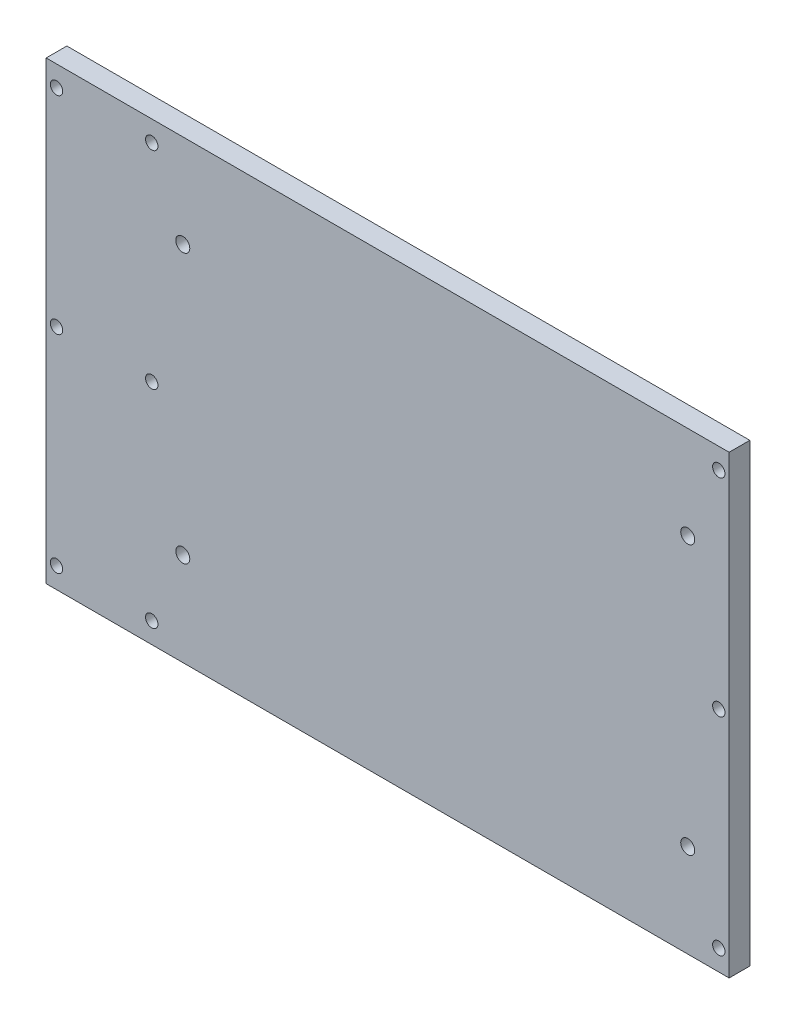
ISO-10303-21;
HEADER;
FILE_DESCRIPTION(('STEP AP214'),'2;1');
FILE_NAME('part.step','',(''),(''),'','','');
FILE_SCHEMA(('AUTOMOTIVE_DESIGN { 1 0 10303 214 1 1 1 1 }'));
ENDSEC;
DATA;
#1=APPLICATION_CONTEXT('core data for automotive mechanical design processes');
#2=APPLICATION_PROTOCOL_DEFINITION('international standard','automotive_design',2000,#1);
#3=PRODUCT_CONTEXT('',#1,'mechanical');
#4=PRODUCT('Part','Part','',(#3));
#5=PRODUCT_RELATED_PRODUCT_CATEGORY('part','',(#4));
#6=PRODUCT_DEFINITION_FORMATION('','',#4);
#7=PRODUCT_DEFINITION_CONTEXT('part definition',#1,'design');
#8=PRODUCT_DEFINITION('design','',#6,#7);
#9=PRODUCT_DEFINITION_SHAPE('','',#8);
#10=(LENGTH_UNIT() NAMED_UNIT(*) SI_UNIT(.MILLI.,.METRE.));
#11=(NAMED_UNIT(*) PLANE_ANGLE_UNIT() SI_UNIT($,.RADIAN.));
#12=(NAMED_UNIT(*) SI_UNIT($,.STERADIAN.) SOLID_ANGLE_UNIT());
#13=UNCERTAINTY_MEASURE_WITH_UNIT(LENGTH_MEASURE(1.E-05),#10,'distance_accuracy_value','');
#14=(GEOMETRIC_REPRESENTATION_CONTEXT(3) GLOBAL_UNCERTAINTY_ASSIGNED_CONTEXT((#13)) GLOBAL_UNIT_ASSIGNED_CONTEXT((#10,
#11,#12)) REPRESENTATION_CONTEXT('',''));
#15=CARTESIAN_POINT('',(0.,0.,0.));
#16=DIRECTION('',(0.,0.,1.));
#17=DIRECTION('',(1.,0.,0.));
#18=AXIS2_PLACEMENT_3D('',#15,#16,#17);
#19=CARTESIAN_POINT('',(-104.775,69.85,3.175));
#20=DIRECTION('',(1.,0.,0.));
#21=DIRECTION('',(0.,1.,0.));
#22=AXIS2_PLACEMENT_3D('',#19,#20,#21);
#23=PLANE('',#22);
#24=DIRECTION('',(0.,-1.,0.));
#25=VECTOR('',#24,1.);
#26=CARTESIAN_POINT('',(-104.775,69.85,-3.175));
#27=LINE('',#26,#25);
#28=CARTESIAN_POINT('',(-104.775,69.85,-3.175));
#29=VERTEX_POINT('',#28);
#30=CARTESIAN_POINT('',(-104.775,-69.85,-3.175));
#31=VERTEX_POINT('',#30);
#32=EDGE_CURVE('E113',#29,#31,#27,.T.);
#33=ORIENTED_EDGE('',*,*,#32,.T.);
#34=DIRECTION('',(0.,0.,-1.));
#35=VECTOR('',#34,1.);
#36=CARTESIAN_POINT('',(-104.775,-69.85,3.175));
#37=LINE('',#36,#35);
#38=CARTESIAN_POINT('',(-104.775,-69.85,3.175));
#39=VERTEX_POINT('',#38);
#40=EDGE_CURVE('E11',#39,#31,#37,.T.);
#41=ORIENTED_EDGE('',*,*,#40,.F.);
#42=DIRECTION('',(0.,-1.,0.));
#43=VECTOR('',#42,1.);
#44=CARTESIAN_POINT('',(-104.775,69.85,3.175));
#45=LINE('',#44,#43);
#46=CARTESIAN_POINT('',(-104.775,69.85,3.175));
#47=VERTEX_POINT('',#46);
#48=EDGE_CURVE('E95',#47,#39,#45,.T.);
#49=ORIENTED_EDGE('',*,*,#48,.F.);
#50=DIRECTION('',(0.,0.,-1.));
#51=VECTOR('',#50,1.);
#52=CARTESIAN_POINT('',(-104.775,69.85,3.175));
#53=LINE('',#52,#51);
#54=EDGE_CURVE('E109',#47,#29,#53,.T.);
#55=ORIENTED_EDGE('',*,*,#54,.T.);
#56=EDGE_LOOP('',(#33,#41,#49,#55));
#57=FACE_BOUND('',#56,.T.);
#58=ADVANCED_FACE('F41',(#57),#23,.F.);
#59=CARTESIAN_POINT('',(104.775,-69.85,3.175));
#60=DIRECTION('',(0.,1.,0.));
#61=DIRECTION('',(-1.,0.,0.));
#62=AXIS2_PLACEMENT_3D('',#59,#60,#61);
#63=PLANE('',#62);
#64=DIRECTION('',(1.,0.,0.));
#65=VECTOR('',#64,1.);
#66=CARTESIAN_POINT('',(104.775,-69.85,-3.175));
#67=LINE('',#66,#65);
#68=CARTESIAN_POINT('',(104.775,-69.85,-3.175));
#69=VERTEX_POINT('',#68);
#70=EDGE_CURVE('E100',#31,#69,#67,.T.);
#71=ORIENTED_EDGE('',*,*,#70,.T.);
#72=DIRECTION('',(0.,0.,-1.));
#73=VECTOR('',#72,1.);
#74=CARTESIAN_POINT('',(104.775,-69.85,3.175));
#75=LINE('',#74,#73);
#76=CARTESIAN_POINT('',(104.775,-69.85,3.175));
#77=VERTEX_POINT('',#76);
#78=EDGE_CURVE('E51',#77,#69,#75,.T.);
#79=ORIENTED_EDGE('',*,*,#78,.F.);
#80=DIRECTION('',(1.,0.,0.));
#81=VECTOR('',#80,1.);
#82=CARTESIAN_POINT('',(104.775,-69.85,3.175));
#83=LINE('',#82,#81);
#84=EDGE_CURVE('E90',#39,#77,#83,.T.);
#85=ORIENTED_EDGE('',*,*,#84,.F.);
#86=ORIENTED_EDGE('',*,*,#40,.T.);
#87=EDGE_LOOP('',(#71,#79,#85,#86));
#88=FACE_BOUND('',#87,.T.);
#89=ADVANCED_FACE('F99',(#88),#63,.F.);
#90=CARTESIAN_POINT('',(104.775,69.85,3.175));
#91=DIRECTION('',(-1.,0.,0.));
#92=DIRECTION('',(0.,-1.,0.));
#93=AXIS2_PLACEMENT_3D('',#90,#91,#92);
#94=PLANE('',#93);
#95=DIRECTION('',(0.,1.,0.));
#96=VECTOR('',#95,1.);
#97=CARTESIAN_POINT('',(104.775,69.85,-3.175));
#98=LINE('',#97,#96);
#99=CARTESIAN_POINT('',(104.775,69.85,-3.175));
#100=VERTEX_POINT('',#99);
#101=EDGE_CURVE('E77',#69,#100,#98,.T.);
#102=ORIENTED_EDGE('',*,*,#101,.T.);
#103=DIRECTION('',(0.,0.,-1.));
#104=VECTOR('',#103,1.);
#105=CARTESIAN_POINT('',(104.775,69.85,3.175));
#106=LINE('',#105,#104);
#107=CARTESIAN_POINT('',(104.775,69.85,3.175));
#108=VERTEX_POINT('',#107);
#109=EDGE_CURVE('E102',#108,#100,#106,.T.);
#110=ORIENTED_EDGE('',*,*,#109,.F.);
#111=DIRECTION('',(0.,1.,0.));
#112=VECTOR('',#111,1.);
#113=CARTESIAN_POINT('',(104.775,69.85,3.175));
#114=LINE('',#113,#112);
#115=EDGE_CURVE('E93',#77,#108,#114,.T.);
#116=ORIENTED_EDGE('',*,*,#115,.F.);
#117=ORIENTED_EDGE('',*,*,#78,.T.);
#118=EDGE_LOOP('',(#102,#110,#116,#117));
#119=FACE_BOUND('',#118,.T.);
#120=ADVANCED_FACE('F104',(#119),#94,.F.);
#121=CARTESIAN_POINT('',(104.775,69.85,3.175));
#122=DIRECTION('',(0.,-1.,0.));
#123=DIRECTION('',(1.,0.,0.));
#124=AXIS2_PLACEMENT_3D('',#121,#122,#123);
#125=PLANE('',#124);
#126=DIRECTION('',(-1.,0.,0.));
#127=VECTOR('',#126,1.);
#128=CARTESIAN_POINT('',(104.775,69.85,-3.175));
#129=LINE('',#128,#127);
#130=EDGE_CURVE('E83',#100,#29,#129,.T.);
#131=ORIENTED_EDGE('',*,*,#130,.T.);
#132=ORIENTED_EDGE('',*,*,#54,.F.);
#133=DIRECTION('',(-1.,0.,0.));
#134=VECTOR('',#133,1.);
#135=CARTESIAN_POINT('',(104.775,69.85,3.175));
#136=LINE('',#135,#134);
#137=EDGE_CURVE('E60',#108,#47,#136,.T.);
#138=ORIENTED_EDGE('',*,*,#137,.F.);
#139=ORIENTED_EDGE('',*,*,#109,.T.);
#140=EDGE_LOOP('',(#131,#132,#138,#139));
#141=FACE_BOUND('',#140,.T.);
#142=ADVANCED_FACE('F311',(#141),#125,.F.);
#143=CARTESIAN_POINT('',(0.,0.,3.175));
#144=DIRECTION('',(0.,0.,-1.));
#145=DIRECTION('',(-1.,0.,0.));
#146=AXIS2_PLACEMENT_3D('',#143,#144,#145);
#147=PLANE('',#146);
#148=CARTESIAN_POINT('',(101.6,63.5,3.17499999999999));
#149=DIRECTION('',(0.,0.,-1.));
#150=DIRECTION('',(-1.,0.,0.));
#151=AXIS2_PLACEMENT_3D('',#148,#149,#150);
#152=CIRCLE('',#151,1.89864999999999);
#153=CARTESIAN_POINT('',(99.70135,63.5,3.17499999999999));
#154=VERTEX_POINT('',#153);
#155=EDGE_CURVE('E265',#154,#154,#152,.T.);
#156=ORIENTED_EDGE('',*,*,#155,.T.);
#157=EDGE_LOOP('',(#156));
#158=FACE_BOUND('',#157,.T.);
#159=CARTESIAN_POINT('',(101.6,0.,3.17499999999999));
#160=DIRECTION('',(0.,0.,-1.));
#161=DIRECTION('',(-1.,0.,0.));
#162=AXIS2_PLACEMENT_3D('',#159,#160,#161);
#163=CIRCLE('',#162,1.89864999999999);
#164=CARTESIAN_POINT('',(99.70135,0.,3.17499999999999));
#165=VERTEX_POINT('',#164);
#166=EDGE_CURVE('E253',#165,#165,#163,.T.);
#167=ORIENTED_EDGE('',*,*,#166,.T.);
#168=EDGE_LOOP('',(#167));
#169=FACE_BOUND('',#168,.T.);
#170=CARTESIAN_POINT('',(101.6,-63.5,3.17499999999999));
#171=DIRECTION('',(0.,0.,-1.));
#172=DIRECTION('',(-1.,0.,0.));
#173=AXIS2_PLACEMENT_3D('',#170,#171,#172);
#174=CIRCLE('',#173,1.89864999999999);
#175=CARTESIAN_POINT('',(99.70135,-63.5,3.17499999999999));
#176=VERTEX_POINT('',#175);
#177=EDGE_CURVE('E241',#176,#176,#174,.T.);
#178=ORIENTED_EDGE('',*,*,#177,.T.);
#179=EDGE_LOOP('',(#178));
#180=FACE_BOUND('',#179,.T.);
#181=CARTESIAN_POINT('',(-72.39,63.5,3.17499999999999));
#182=DIRECTION('',(0.,0.,-1.));
#183=DIRECTION('',(-1.,0.,0.));
#184=AXIS2_PLACEMENT_3D('',#181,#182,#183);
#185=CIRCLE('',#184,1.89864999999999);
#186=CARTESIAN_POINT('',(-74.28865,63.5,3.17499999999999));
#187=VERTEX_POINT('',#186);
#188=EDGE_CURVE('E229',#187,#187,#185,.T.);
#189=ORIENTED_EDGE('',*,*,#188,.T.);
#190=EDGE_LOOP('',(#189));
#191=FACE_BOUND('',#190,.T.);
#192=CARTESIAN_POINT('',(-72.39,0.,3.17499999999999));
#193=DIRECTION('',(0.,0.,-1.));
#194=DIRECTION('',(-1.,0.,0.));
#195=AXIS2_PLACEMENT_3D('',#192,#193,#194);
#196=CIRCLE('',#195,1.89864999999999);
#197=CARTESIAN_POINT('',(-74.28865,0.,3.17499999999999));
#198=VERTEX_POINT('',#197);
#199=EDGE_CURVE('E217',#198,#198,#196,.T.);
#200=ORIENTED_EDGE('',*,*,#199,.T.);
#201=EDGE_LOOP('',(#200));
#202=FACE_BOUND('',#201,.T.);
#203=CARTESIAN_POINT('',(-72.39,-63.5,3.17499999999999));
#204=DIRECTION('',(0.,0.,-1.));
#205=DIRECTION('',(-1.,0.,0.));
#206=AXIS2_PLACEMENT_3D('',#203,#204,#205);
#207=CIRCLE('',#206,1.89864999999999);
#208=CARTESIAN_POINT('',(-74.28865,-63.5,3.17499999999999));
#209=VERTEX_POINT('',#208);
#210=EDGE_CURVE('E205',#209,#209,#207,.T.);
#211=ORIENTED_EDGE('',*,*,#210,.T.);
#212=EDGE_LOOP('',(#211));
#213=FACE_BOUND('',#212,.T.);
#214=CARTESIAN_POINT('',(-101.6,-63.5,3.17499999999999));
#215=DIRECTION('',(0.,0.,-1.));
#216=DIRECTION('',(-1.,0.,0.));
#217=AXIS2_PLACEMENT_3D('',#214,#215,#216);
#218=CIRCLE('',#217,1.89864999999999);
#219=CARTESIAN_POINT('',(-103.49865,-63.5,3.17499999999999));
#220=VERTEX_POINT('',#219);
#221=EDGE_CURVE('E193',#220,#220,#218,.T.);
#222=ORIENTED_EDGE('',*,*,#221,.T.);
#223=EDGE_LOOP('',(#222));
#224=FACE_BOUND('',#223,.T.);
#225=CARTESIAN_POINT('',(-101.6,0.,3.17499999999999));
#226=DIRECTION('',(0.,0.,-1.));
#227=DIRECTION('',(-1.,0.,0.));
#228=AXIS2_PLACEMENT_3D('',#225,#226,#227);
#229=CIRCLE('',#228,1.89864999999999);
#230=CARTESIAN_POINT('',(-103.49865,0.,3.17499999999999));
#231=VERTEX_POINT('',#230);
#232=EDGE_CURVE('E181',#231,#231,#229,.T.);
#233=ORIENTED_EDGE('',*,*,#232,.T.);
#234=EDGE_LOOP('',(#233));
#235=FACE_BOUND('',#234,.T.);
#236=CARTESIAN_POINT('',(-101.6,63.5,3.17499999999999));
#237=DIRECTION('',(0.,0.,-1.));
#238=DIRECTION('',(-1.,0.,0.));
#239=AXIS2_PLACEMENT_3D('',#236,#237,#238);
#240=CIRCLE('',#239,1.89864999999999);
#241=CARTESIAN_POINT('',(-103.49865,63.5,3.17499999999999));
#242=VERTEX_POINT('',#241);
#243=EDGE_CURVE('E169',#242,#242,#240,.T.);
#244=ORIENTED_EDGE('',*,*,#243,.T.);
#245=EDGE_LOOP('',(#244));
#246=FACE_BOUND('',#245,.T.);
#247=CARTESIAN_POINT('',(-62.865,41.275,3.175));
#248=DIRECTION('',(0.,0.,1.));
#249=DIRECTION('',(1.,0.,0.));
#250=AXIS2_PLACEMENT_3D('',#247,#248,#249);
#251=CIRCLE('',#250,2.15265);
#252=CARTESIAN_POINT('',(-60.71235,41.275,3.175));
#253=VERTEX_POINT('',#252);
#254=EDGE_CURVE('E165',#253,#253,#251,.T.);
#255=ORIENTED_EDGE('',*,*,#254,.F.);
#256=EDGE_LOOP('',(#255));
#257=FACE_BOUND('',#256,.T.);
#258=CARTESIAN_POINT('',(92.075,41.275,3.175));
#259=DIRECTION('',(0.,0.,1.));
#260=DIRECTION('',(1.,0.,0.));
#261=AXIS2_PLACEMENT_3D('',#258,#259,#260);
#262=CIRCLE('',#261,2.15265000000001);
#263=CARTESIAN_POINT('',(94.22765,41.275,3.175));
#264=VERTEX_POINT('',#263);
#265=EDGE_CURVE('E157',#264,#264,#262,.T.);
#266=ORIENTED_EDGE('',*,*,#265,.F.);
#267=EDGE_LOOP('',(#266));
#268=FACE_BOUND('',#267,.T.);
#269=CARTESIAN_POINT('',(92.075,-41.275,3.175));
#270=DIRECTION('',(0.,0.,1.));
#271=DIRECTION('',(1.,0.,0.));
#272=AXIS2_PLACEMENT_3D('',#269,#270,#271);
#273=CIRCLE('',#272,2.15265000000001);
#274=CARTESIAN_POINT('',(94.22765,-41.275,3.175));
#275=VERTEX_POINT('',#274);
#276=EDGE_CURVE('E141',#275,#275,#273,.T.);
#277=ORIENTED_EDGE('',*,*,#276,.F.);
#278=EDGE_LOOP('',(#277));
#279=FACE_BOUND('',#278,.T.);
#280=CARTESIAN_POINT('',(-62.865,-41.275,3.175));
#281=DIRECTION('',(0.,0.,1.));
#282=DIRECTION('',(1.,0.,0.));
#283=AXIS2_PLACEMENT_3D('',#280,#281,#282);
#284=CIRCLE('',#283,2.15265);
#285=CARTESIAN_POINT('',(-60.71235,-41.275,3.175));
#286=VERTEX_POINT('',#285);
#287=EDGE_CURVE('E129',#286,#286,#284,.T.);
#288=ORIENTED_EDGE('',*,*,#287,.F.);
#289=EDGE_LOOP('',(#288));
#290=FACE_BOUND('',#289,.T.);
#291=ORIENTED_EDGE('',*,*,#48,.T.);
#292=ORIENTED_EDGE('',*,*,#84,.T.);
#293=ORIENTED_EDGE('',*,*,#115,.T.);
#294=ORIENTED_EDGE('',*,*,#137,.T.);
#295=EDGE_LOOP('',(#291,#292,#293,#294));
#296=FACE_BOUND('',#295,.T.);
#297=ADVANCED_FACE('F91',(#158,#169,#180,#191,#202,#213,#224,#235,#246,#257,#268,#279,#290,
#296),#147,.F.);
#298=CARTESIAN_POINT('',(0.,0.,-3.175));
#299=DIRECTION('',(0.,0.,-1.));
#300=DIRECTION('',(-1.,0.,0.));
#301=AXIS2_PLACEMENT_3D('',#298,#299,#300);
#302=PLANE('',#301);
#303=CARTESIAN_POINT('',(101.6,63.5,-3.175));
#304=DIRECTION('',(0.,0.,-1.));
#305=DIRECTION('',(-1.,0.,0.));
#306=AXIS2_PLACEMENT_3D('',#303,#304,#305);
#307=CIRCLE('',#306,2.53365);
#308=CARTESIAN_POINT('',(99.06635,63.5,-3.175));
#309=VERTEX_POINT('',#308);
#310=EDGE_CURVE('E273',#309,#309,#307,.T.);
#311=ORIENTED_EDGE('',*,*,#310,.F.);
#312=EDGE_LOOP('',(#311));
#313=FACE_BOUND('',#312,.T.);
#314=CARTESIAN_POINT('',(101.6,0.,-3.175));
#315=DIRECTION('',(0.,0.,-1.));
#316=DIRECTION('',(-1.,0.,0.));
#317=AXIS2_PLACEMENT_3D('',#314,#315,#316);
#318=CIRCLE('',#317,2.53365);
#319=CARTESIAN_POINT('',(99.06635,0.,-3.175));
#320=VERTEX_POINT('',#319);
#321=EDGE_CURVE('E261',#320,#320,#318,.T.);
#322=ORIENTED_EDGE('',*,*,#321,.F.);
#323=EDGE_LOOP('',(#322));
#324=FACE_BOUND('',#323,.T.);
#325=CARTESIAN_POINT('',(101.6,-63.5,-3.175));
#326=DIRECTION('',(0.,0.,-1.));
#327=DIRECTION('',(-1.,0.,0.));
#328=AXIS2_PLACEMENT_3D('',#325,#326,#327);
#329=CIRCLE('',#328,2.53365);
#330=CARTESIAN_POINT('',(99.06635,-63.5,-3.175));
#331=VERTEX_POINT('',#330);
#332=EDGE_CURVE('E249',#331,#331,#329,.T.);
#333=ORIENTED_EDGE('',*,*,#332,.F.);
#334=EDGE_LOOP('',(#333));
#335=FACE_BOUND('',#334,.T.);
#336=CARTESIAN_POINT('',(-72.39,63.5,-3.175));
#337=DIRECTION('',(0.,0.,-1.));
#338=DIRECTION('',(-1.,0.,0.));
#339=AXIS2_PLACEMENT_3D('',#336,#337,#338);
#340=CIRCLE('',#339,2.53365);
#341=CARTESIAN_POINT('',(-74.92365,63.5,-3.175));
#342=VERTEX_POINT('',#341);
#343=EDGE_CURVE('E237',#342,#342,#340,.T.);
#344=ORIENTED_EDGE('',*,*,#343,.F.);
#345=EDGE_LOOP('',(#344));
#346=FACE_BOUND('',#345,.T.);
#347=CARTESIAN_POINT('',(-72.39,0.,-3.175));
#348=DIRECTION('',(0.,0.,-1.));
#349=DIRECTION('',(-1.,0.,0.));
#350=AXIS2_PLACEMENT_3D('',#347,#348,#349);
#351=CIRCLE('',#350,2.53365);
#352=CARTESIAN_POINT('',(-74.92365,0.,-3.175));
#353=VERTEX_POINT('',#352);
#354=EDGE_CURVE('E225',#353,#353,#351,.T.);
#355=ORIENTED_EDGE('',*,*,#354,.F.);
#356=EDGE_LOOP('',(#355));
#357=FACE_BOUND('',#356,.T.);
#358=CARTESIAN_POINT('',(-72.39,-63.5,-3.175));
#359=DIRECTION('',(0.,0.,-1.));
#360=DIRECTION('',(-1.,0.,0.));
#361=AXIS2_PLACEMENT_3D('',#358,#359,#360);
#362=CIRCLE('',#361,2.53365);
#363=CARTESIAN_POINT('',(-74.92365,-63.5,-3.175));
#364=VERTEX_POINT('',#363);
#365=EDGE_CURVE('E213',#364,#364,#362,.T.);
#366=ORIENTED_EDGE('',*,*,#365,.F.);
#367=EDGE_LOOP('',(#366));
#368=FACE_BOUND('',#367,.T.);
#369=CARTESIAN_POINT('',(-101.6,-63.5,-3.175));
#370=DIRECTION('',(0.,0.,-1.));
#371=DIRECTION('',(-1.,0.,0.));
#372=AXIS2_PLACEMENT_3D('',#369,#370,#371);
#373=CIRCLE('',#372,2.53365);
#374=CARTESIAN_POINT('',(-104.13365,-63.5,-3.175));
#375=VERTEX_POINT('',#374);
#376=EDGE_CURVE('E201',#375,#375,#373,.T.);
#377=ORIENTED_EDGE('',*,*,#376,.F.);
#378=EDGE_LOOP('',(#377));
#379=FACE_BOUND('',#378,.T.);
#380=CARTESIAN_POINT('',(-101.6,0.,-3.175));
#381=DIRECTION('',(0.,0.,-1.));
#382=DIRECTION('',(-1.,0.,0.));
#383=AXIS2_PLACEMENT_3D('',#380,#381,#382);
#384=CIRCLE('',#383,2.53365);
#385=CARTESIAN_POINT('',(-104.13365,0.,-3.175));
#386=VERTEX_POINT('',#385);
#387=EDGE_CURVE('E189',#386,#386,#384,.T.);
#388=ORIENTED_EDGE('',*,*,#387,.F.);
#389=EDGE_LOOP('',(#388));
#390=FACE_BOUND('',#389,.T.);
#391=CARTESIAN_POINT('',(-101.6,63.5,-3.175));
#392=DIRECTION('',(0.,0.,-1.));
#393=DIRECTION('',(-1.,0.,0.));
#394=AXIS2_PLACEMENT_3D('',#391,#392,#393);
#395=CIRCLE('',#394,2.53365);
#396=CARTESIAN_POINT('',(-104.13365,63.5,-3.175));
#397=VERTEX_POINT('',#396);
#398=EDGE_CURVE('E177',#397,#397,#395,.T.);
#399=ORIENTED_EDGE('',*,*,#398,.F.);
#400=EDGE_LOOP('',(#399));
#401=FACE_BOUND('',#400,.T.);
#402=CARTESIAN_POINT('',(-62.865,41.275,-3.175));
#403=DIRECTION('',(0.,0.,-1.));
#404=DIRECTION('',(-1.,0.,0.));
#405=AXIS2_PLACEMENT_3D('',#402,#403,#404);
#406=CIRCLE('',#405,2.15265);
#407=CARTESIAN_POINT('',(-65.01765,41.275,-3.175));
#408=VERTEX_POINT('',#407);
#409=EDGE_CURVE('E161',#408,#408,#406,.T.);
#410=ORIENTED_EDGE('',*,*,#409,.F.);
#411=EDGE_LOOP('',(#410));
#412=FACE_BOUND('',#411,.T.);
#413=CARTESIAN_POINT('',(92.075,41.275,-3.175));
#414=DIRECTION('',(0.,0.,-1.));
#415=DIRECTION('',(-1.,0.,0.));
#416=AXIS2_PLACEMENT_3D('',#413,#414,#415);
#417=CIRCLE('',#416,2.15265);
#418=CARTESIAN_POINT('',(89.92235,41.275,-3.175));
#419=VERTEX_POINT('',#418);
#420=EDGE_CURVE('E153',#419,#419,#417,.T.);
#421=ORIENTED_EDGE('',*,*,#420,.F.);
#422=EDGE_LOOP('',(#421));
#423=FACE_BOUND('',#422,.T.);
#424=CARTESIAN_POINT('',(92.075,-41.275,-3.175));
#425=DIRECTION('',(0.,0.,-1.));
#426=DIRECTION('',(-1.,0.,0.));
#427=AXIS2_PLACEMENT_3D('',#424,#425,#426);
#428=CIRCLE('',#427,2.15265);
#429=CARTESIAN_POINT('',(89.92235,-41.275,-3.175));
#430=VERTEX_POINT('',#429);
#431=EDGE_CURVE('E44',#430,#430,#428,.T.);
#432=ORIENTED_EDGE('',*,*,#431,.F.);
#433=EDGE_LOOP('',(#432));
#434=FACE_BOUND('',#433,.T.);
#435=CARTESIAN_POINT('',(-62.865,-41.275,-3.175));
#436=DIRECTION('',(0.,0.,-1.));
#437=DIRECTION('',(-1.,0.,0.));
#438=AXIS2_PLACEMENT_3D('',#435,#436,#437);
#439=CIRCLE('',#438,2.15265);
#440=CARTESIAN_POINT('',(-65.01765,-41.275,-3.175));
#441=VERTEX_POINT('',#440);
#442=EDGE_CURVE('E117',#441,#441,#439,.T.);
#443=ORIENTED_EDGE('',*,*,#442,.F.);
#444=EDGE_LOOP('',(#443));
#445=FACE_BOUND('',#444,.T.);
#446=ORIENTED_EDGE('',*,*,#32,.F.);
#447=ORIENTED_EDGE('',*,*,#130,.F.);
#448=ORIENTED_EDGE('',*,*,#101,.F.);
#449=ORIENTED_EDGE('',*,*,#70,.F.);
#450=EDGE_LOOP('',(#446,#447,#448,#449));
#451=FACE_BOUND('',#450,.T.);
#452=ADVANCED_FACE('F281',(#313,#324,#335,#346,#357,#368,#379,#390,#401,#412,#423,#434,#445,
#451),#302,.T.);
#453=CARTESIAN_POINT('',(-62.865,-41.275,3.175));
#454=DIRECTION('',(0.,0.,1.));
#455=DIRECTION('',(1.,0.,0.));
#456=AXIS2_PLACEMENT_3D('',#453,#454,#455);
#457=CYLINDRICAL_SURFACE('',#456,2.15265);
#458=ORIENTED_EDGE('',*,*,#442,.T.);
#459=EDGE_LOOP('',(#458));
#460=FACE_BOUND('',#459,.T.);
#461=ORIENTED_EDGE('',*,*,#287,.T.);
#462=EDGE_LOOP('',(#461));
#463=FACE_BOUND('',#462,.T.);
#464=ADVANCED_FACE('F284',(#460,#463),#457,.F.);
#465=CARTESIAN_POINT('',(92.075,-41.275,3.175));
#466=DIRECTION('',(0.,0.,1.));
#467=DIRECTION('',(1.,0.,0.));
#468=AXIS2_PLACEMENT_3D('',#465,#466,#467);
#469=CYLINDRICAL_SURFACE('',#468,2.15265);
#470=ORIENTED_EDGE('',*,*,#431,.T.);
#471=EDGE_LOOP('',(#470));
#472=FACE_BOUND('',#471,.T.);
#473=ORIENTED_EDGE('',*,*,#276,.T.);
#474=EDGE_LOOP('',(#473));
#475=FACE_BOUND('',#474,.T.);
#476=ADVANCED_FACE('F345',(#472,#475),#469,.F.);
#477=CARTESIAN_POINT('',(92.075,41.275,3.175));
#478=DIRECTION('',(0.,0.,1.));
#479=DIRECTION('',(1.,0.,0.));
#480=AXIS2_PLACEMENT_3D('',#477,#478,#479);
#481=CYLINDRICAL_SURFACE('',#480,2.15265);
#482=ORIENTED_EDGE('',*,*,#420,.T.);
#483=EDGE_LOOP('',(#482));
#484=FACE_BOUND('',#483,.T.);
#485=ORIENTED_EDGE('',*,*,#265,.T.);
#486=EDGE_LOOP('',(#485));
#487=FACE_BOUND('',#486,.T.);
#488=ADVANCED_FACE('F355',(#484,#487),#481,.F.);
#489=CARTESIAN_POINT('',(-62.865,41.275,3.175));
#490=DIRECTION('',(0.,0.,1.));
#491=DIRECTION('',(1.,0.,0.));
#492=AXIS2_PLACEMENT_3D('',#489,#490,#491);
#493=CYLINDRICAL_SURFACE('',#492,2.15265);
#494=ORIENTED_EDGE('',*,*,#409,.T.);
#495=EDGE_LOOP('',(#494));
#496=FACE_BOUND('',#495,.T.);
#497=ORIENTED_EDGE('',*,*,#254,.T.);
#498=EDGE_LOOP('',(#497));
#499=FACE_BOUND('',#498,.T.);
#500=ADVANCED_FACE('F365',(#496,#499),#493,.F.);
#501=CARTESIAN_POINT('',(-101.6,63.5,-3.175));
#502=DIRECTION('',(0.,0.,-1.));
#503=DIRECTION('',(-1.,0.,0.));
#504=AXIS2_PLACEMENT_3D('',#501,#502,#503);
#505=CYLINDRICAL_SURFACE('',#504,1.89864999999999);
#506=ORIENTED_EDGE('',*,*,#243,.F.);
#507=EDGE_LOOP('',(#506));
#508=FACE_BOUND('',#507,.T.);
#509=CARTESIAN_POINT('',(-101.6,63.5,-2.54));
#510=DIRECTION('',(0.,0.,-1.));
#511=DIRECTION('',(-1.,0.,0.));
#512=AXIS2_PLACEMENT_3D('',#509,#510,#511);
#513=CIRCLE('',#512,1.89865);
#514=CARTESIAN_POINT('',(-103.49865,63.5,-2.54));
#515=VERTEX_POINT('',#514);
#516=EDGE_CURVE('E173',#515,#515,#513,.T.);
#517=ORIENTED_EDGE('',*,*,#516,.T.);
#518=EDGE_LOOP('',(#517));
#519=FACE_BOUND('',#518,.T.);
#520=ADVANCED_FACE('F375',(#508,#519),#505,.F.);
#521=CARTESIAN_POINT('',(-101.6,63.5,-3.175));
#522=DIRECTION('',(0.,0.,-1.));
#523=DIRECTION('',(-1.,0.,0.));
#524=AXIS2_PLACEMENT_3D('',#521,#522,#523);
#525=CONICAL_SURFACE('',#524,2.53365,0.785398163397446);
#526=ORIENTED_EDGE('',*,*,#516,.F.);
#527=EDGE_LOOP('',(#526));
#528=FACE_BOUND('',#527,.T.);
#529=ORIENTED_EDGE('',*,*,#398,.T.);
#530=EDGE_LOOP('',(#529));
#531=FACE_BOUND('',#530,.T.);
#532=ADVANCED_FACE('F395',(#528,#531),#525,.F.);
#533=CARTESIAN_POINT('',(-101.6,0.,-3.175));
#534=DIRECTION('',(0.,0.,-1.));
#535=DIRECTION('',(-1.,0.,0.));
#536=AXIS2_PLACEMENT_3D('',#533,#534,#535);
#537=CYLINDRICAL_SURFACE('',#536,1.89864999999999);
#538=ORIENTED_EDGE('',*,*,#232,.F.);
#539=EDGE_LOOP('',(#538));
#540=FACE_BOUND('',#539,.T.);
#541=CARTESIAN_POINT('',(-101.6,0.,-2.54));
#542=DIRECTION('',(0.,0.,-1.));
#543=DIRECTION('',(-1.,0.,0.));
#544=AXIS2_PLACEMENT_3D('',#541,#542,#543);
#545=CIRCLE('',#544,1.89865);
#546=CARTESIAN_POINT('',(-103.49865,0.,-2.54));
#547=VERTEX_POINT('',#546);
#548=EDGE_CURVE('E185',#547,#547,#545,.T.);
#549=ORIENTED_EDGE('',*,*,#548,.T.);
#550=EDGE_LOOP('',(#549));
#551=FACE_BOUND('',#550,.T.);
#552=ADVANCED_FACE('F405',(#540,#551),#537,.F.);
#553=CARTESIAN_POINT('',(-101.6,0.,-3.175));
#554=DIRECTION('',(0.,0.,-1.));
#555=DIRECTION('',(-1.,0.,0.));
#556=AXIS2_PLACEMENT_3D('',#553,#554,#555);
#557=CONICAL_SURFACE('',#556,2.53365,0.785398163397446);
#558=ORIENTED_EDGE('',*,*,#548,.F.);
#559=EDGE_LOOP('',(#558));
#560=FACE_BOUND('',#559,.T.);
#561=ORIENTED_EDGE('',*,*,#387,.T.);
#562=EDGE_LOOP('',(#561));
#563=FACE_BOUND('',#562,.T.);
#564=ADVANCED_FACE('F415',(#560,#563),#557,.F.);
#565=CARTESIAN_POINT('',(-101.6,-63.5,-3.175));
#566=DIRECTION('',(0.,0.,-1.));
#567=DIRECTION('',(-1.,0.,0.));
#568=AXIS2_PLACEMENT_3D('',#565,#566,#567);
#569=CYLINDRICAL_SURFACE('',#568,1.89864999999999);
#570=ORIENTED_EDGE('',*,*,#221,.F.);
#571=EDGE_LOOP('',(#570));
#572=FACE_BOUND('',#571,.T.);
#573=CARTESIAN_POINT('',(-101.6,-63.5,-2.54));
#574=DIRECTION('',(0.,0.,-1.));
#575=DIRECTION('',(-1.,0.,0.));
#576=AXIS2_PLACEMENT_3D('',#573,#574,#575);
#577=CIRCLE('',#576,1.89865);
#578=CARTESIAN_POINT('',(-103.49865,-63.5,-2.54));
#579=VERTEX_POINT('',#578);
#580=EDGE_CURVE('E197',#579,#579,#577,.T.);
#581=ORIENTED_EDGE('',*,*,#580,.T.);
#582=EDGE_LOOP('',(#581));
#583=FACE_BOUND('',#582,.T.);
#584=ADVANCED_FACE('F425',(#572,#583),#569,.F.);
#585=CARTESIAN_POINT('',(-101.6,-63.5,-3.175));
#586=DIRECTION('',(0.,0.,-1.));
#587=DIRECTION('',(-1.,0.,0.));
#588=AXIS2_PLACEMENT_3D('',#585,#586,#587);
#589=CONICAL_SURFACE('',#588,2.53365,0.785398163397446);
#590=ORIENTED_EDGE('',*,*,#580,.F.);
#591=EDGE_LOOP('',(#590));
#592=FACE_BOUND('',#591,.T.);
#593=ORIENTED_EDGE('',*,*,#376,.T.);
#594=EDGE_LOOP('',(#593));
#595=FACE_BOUND('',#594,.T.);
#596=ADVANCED_FACE('F435',(#592,#595),#589,.F.);
#597=CARTESIAN_POINT('',(-72.39,-63.5,-3.175));
#598=DIRECTION('',(0.,0.,-1.));
#599=DIRECTION('',(-1.,0.,0.));
#600=AXIS2_PLACEMENT_3D('',#597,#598,#599);
#601=CYLINDRICAL_SURFACE('',#600,1.89864999999999);
#602=ORIENTED_EDGE('',*,*,#210,.F.);
#603=EDGE_LOOP('',(#602));
#604=FACE_BOUND('',#603,.T.);
#605=CARTESIAN_POINT('',(-72.39,-63.5,-2.54));
#606=DIRECTION('',(0.,0.,-1.));
#607=DIRECTION('',(-1.,0.,0.));
#608=AXIS2_PLACEMENT_3D('',#605,#606,#607);
#609=CIRCLE('',#608,1.89865);
#610=CARTESIAN_POINT('',(-74.28865,-63.5,-2.54));
#611=VERTEX_POINT('',#610);
#612=EDGE_CURVE('E209',#611,#611,#609,.T.);
#613=ORIENTED_EDGE('',*,*,#612,.T.);
#614=EDGE_LOOP('',(#613));
#615=FACE_BOUND('',#614,.T.);
#616=ADVANCED_FACE('F445',(#604,#615),#601,.F.);
#617=CARTESIAN_POINT('',(-72.39,-63.5,-3.175));
#618=DIRECTION('',(0.,0.,-1.));
#619=DIRECTION('',(-1.,0.,0.));
#620=AXIS2_PLACEMENT_3D('',#617,#618,#619);
#621=CONICAL_SURFACE('',#620,2.53365,0.785398163397446);
#622=ORIENTED_EDGE('',*,*,#612,.F.);
#623=EDGE_LOOP('',(#622));
#624=FACE_BOUND('',#623,.T.);
#625=ORIENTED_EDGE('',*,*,#365,.T.);
#626=EDGE_LOOP('',(#625));
#627=FACE_BOUND('',#626,.T.);
#628=ADVANCED_FACE('F455',(#624,#627),#621,.F.);
#629=CARTESIAN_POINT('',(-72.39,0.,-3.175));
#630=DIRECTION('',(0.,0.,-1.));
#631=DIRECTION('',(-1.,0.,0.));
#632=AXIS2_PLACEMENT_3D('',#629,#630,#631);
#633=CYLINDRICAL_SURFACE('',#632,1.89864999999999);
#634=ORIENTED_EDGE('',*,*,#199,.F.);
#635=EDGE_LOOP('',(#634));
#636=FACE_BOUND('',#635,.T.);
#637=CARTESIAN_POINT('',(-72.39,0.,-2.54));
#638=DIRECTION('',(0.,0.,-1.));
#639=DIRECTION('',(-1.,0.,0.));
#640=AXIS2_PLACEMENT_3D('',#637,#638,#639);
#641=CIRCLE('',#640,1.89865);
#642=CARTESIAN_POINT('',(-74.28865,0.,-2.54));
#643=VERTEX_POINT('',#642);
#644=EDGE_CURVE('E221',#643,#643,#641,.T.);
#645=ORIENTED_EDGE('',*,*,#644,.T.);
#646=EDGE_LOOP('',(#645));
#647=FACE_BOUND('',#646,.T.);
#648=ADVANCED_FACE('F465',(#636,#647),#633,.F.);
#649=CARTESIAN_POINT('',(-72.39,0.,-3.175));
#650=DIRECTION('',(0.,0.,-1.));
#651=DIRECTION('',(-1.,0.,0.));
#652=AXIS2_PLACEMENT_3D('',#649,#650,#651);
#653=CONICAL_SURFACE('',#652,2.53365,0.785398163397446);
#654=ORIENTED_EDGE('',*,*,#644,.F.);
#655=EDGE_LOOP('',(#654));
#656=FACE_BOUND('',#655,.T.);
#657=ORIENTED_EDGE('',*,*,#354,.T.);
#658=EDGE_LOOP('',(#657));
#659=FACE_BOUND('',#658,.T.);
#660=ADVANCED_FACE('F475',(#656,#659),#653,.F.);
#661=CARTESIAN_POINT('',(-72.39,63.5,-3.175));
#662=DIRECTION('',(0.,0.,-1.));
#663=DIRECTION('',(-1.,0.,0.));
#664=AXIS2_PLACEMENT_3D('',#661,#662,#663);
#665=CYLINDRICAL_SURFACE('',#664,1.89864999999999);
#666=ORIENTED_EDGE('',*,*,#188,.F.);
#667=EDGE_LOOP('',(#666));
#668=FACE_BOUND('',#667,.T.);
#669=CARTESIAN_POINT('',(-72.39,63.5,-2.54));
#670=DIRECTION('',(0.,0.,-1.));
#671=DIRECTION('',(-1.,0.,0.));
#672=AXIS2_PLACEMENT_3D('',#669,#670,#671);
#673=CIRCLE('',#672,1.89865);
#674=CARTESIAN_POINT('',(-74.28865,63.5,-2.54));
#675=VERTEX_POINT('',#674);
#676=EDGE_CURVE('E233',#675,#675,#673,.T.);
#677=ORIENTED_EDGE('',*,*,#676,.T.);
#678=EDGE_LOOP('',(#677));
#679=FACE_BOUND('',#678,.T.);
#680=ADVANCED_FACE('F485',(#668,#679),#665,.F.);
#681=CARTESIAN_POINT('',(-72.39,63.5,-3.175));
#682=DIRECTION('',(0.,0.,-1.));
#683=DIRECTION('',(-1.,0.,0.));
#684=AXIS2_PLACEMENT_3D('',#681,#682,#683);
#685=CONICAL_SURFACE('',#684,2.53365,0.785398163397446);
#686=ORIENTED_EDGE('',*,*,#676,.F.);
#687=EDGE_LOOP('',(#686));
#688=FACE_BOUND('',#687,.T.);
#689=ORIENTED_EDGE('',*,*,#343,.T.);
#690=EDGE_LOOP('',(#689));
#691=FACE_BOUND('',#690,.T.);
#692=ADVANCED_FACE('F495',(#688,#691),#685,.F.);
#693=CARTESIAN_POINT('',(101.6,-63.5,-3.175));
#694=DIRECTION('',(0.,0.,-1.));
#695=DIRECTION('',(-1.,0.,0.));
#696=AXIS2_PLACEMENT_3D('',#693,#694,#695);
#697=CYLINDRICAL_SURFACE('',#696,1.89864999999999);
#698=ORIENTED_EDGE('',*,*,#177,.F.);
#699=EDGE_LOOP('',(#698));
#700=FACE_BOUND('',#699,.T.);
#701=CARTESIAN_POINT('',(101.6,-63.5,-2.54));
#702=DIRECTION('',(0.,0.,-1.));
#703=DIRECTION('',(-1.,0.,0.));
#704=AXIS2_PLACEMENT_3D('',#701,#702,#703);
#705=CIRCLE('',#704,1.89865);
#706=CARTESIAN_POINT('',(99.70135,-63.5,-2.54));
#707=VERTEX_POINT('',#706);
#708=EDGE_CURVE('E245',#707,#707,#705,.T.);
#709=ORIENTED_EDGE('',*,*,#708,.T.);
#710=EDGE_LOOP('',(#709));
#711=FACE_BOUND('',#710,.T.);
#712=ADVANCED_FACE('F505',(#700,#711),#697,.F.);
#713=CARTESIAN_POINT('',(101.6,-63.5,-3.175));
#714=DIRECTION('',(0.,0.,-1.));
#715=DIRECTION('',(-1.,0.,0.));
#716=AXIS2_PLACEMENT_3D('',#713,#714,#715);
#717=CONICAL_SURFACE('',#716,2.53365,0.785398163397446);
#718=ORIENTED_EDGE('',*,*,#708,.F.);
#719=EDGE_LOOP('',(#718));
#720=FACE_BOUND('',#719,.T.);
#721=ORIENTED_EDGE('',*,*,#332,.T.);
#722=EDGE_LOOP('',(#721));
#723=FACE_BOUND('',#722,.T.);
#724=ADVANCED_FACE('F515',(#720,#723),#717,.F.);
#725=CARTESIAN_POINT('',(101.6,0.,-3.175));
#726=DIRECTION('',(0.,0.,-1.));
#727=DIRECTION('',(-1.,0.,0.));
#728=AXIS2_PLACEMENT_3D('',#725,#726,#727);
#729=CYLINDRICAL_SURFACE('',#728,1.89864999999999);
#730=ORIENTED_EDGE('',*,*,#166,.F.);
#731=EDGE_LOOP('',(#730));
#732=FACE_BOUND('',#731,.T.);
#733=CARTESIAN_POINT('',(101.6,0.,-2.54));
#734=DIRECTION('',(0.,0.,-1.));
#735=DIRECTION('',(-1.,0.,0.));
#736=AXIS2_PLACEMENT_3D('',#733,#734,#735);
#737=CIRCLE('',#736,1.89865);
#738=CARTESIAN_POINT('',(99.70135,0.,-2.54));
#739=VERTEX_POINT('',#738);
#740=EDGE_CURVE('E257',#739,#739,#737,.T.);
#741=ORIENTED_EDGE('',*,*,#740,.T.);
#742=EDGE_LOOP('',(#741));
#743=FACE_BOUND('',#742,.T.);
#744=ADVANCED_FACE('F525',(#732,#743),#729,.F.);
#745=CARTESIAN_POINT('',(101.6,0.,-3.175));
#746=DIRECTION('',(0.,0.,-1.));
#747=DIRECTION('',(-1.,0.,0.));
#748=AXIS2_PLACEMENT_3D('',#745,#746,#747);
#749=CONICAL_SURFACE('',#748,2.53365,0.785398163397446);
#750=ORIENTED_EDGE('',*,*,#740,.F.);
#751=EDGE_LOOP('',(#750));
#752=FACE_BOUND('',#751,.T.);
#753=ORIENTED_EDGE('',*,*,#321,.T.);
#754=EDGE_LOOP('',(#753));
#755=FACE_BOUND('',#754,.T.);
#756=ADVANCED_FACE('F535',(#752,#755),#749,.F.);
#757=CARTESIAN_POINT('',(101.6,63.5,-3.175));
#758=DIRECTION('',(0.,0.,-1.));
#759=DIRECTION('',(-1.,0.,0.));
#760=AXIS2_PLACEMENT_3D('',#757,#758,#759);
#761=CYLINDRICAL_SURFACE('',#760,1.89864999999999);
#762=ORIENTED_EDGE('',*,*,#155,.F.);
#763=EDGE_LOOP('',(#762));
#764=FACE_BOUND('',#763,.T.);
#765=CARTESIAN_POINT('',(101.6,63.5,-2.54));
#766=DIRECTION('',(0.,0.,-1.));
#767=DIRECTION('',(-1.,0.,0.));
#768=AXIS2_PLACEMENT_3D('',#765,#766,#767);
#769=CIRCLE('',#768,1.89865);
#770=CARTESIAN_POINT('',(99.70135,63.5,-2.54));
#771=VERTEX_POINT('',#770);
#772=EDGE_CURVE('E269',#771,#771,#769,.T.);
#773=ORIENTED_EDGE('',*,*,#772,.T.);
#774=EDGE_LOOP('',(#773));
#775=FACE_BOUND('',#774,.T.);
#776=ADVANCED_FACE('F545',(#764,#775),#761,.F.);
#777=CARTESIAN_POINT('',(101.6,63.5,-3.175));
#778=DIRECTION('',(0.,0.,-1.));
#779=DIRECTION('',(-1.,0.,0.));
#780=AXIS2_PLACEMENT_3D('',#777,#778,#779);
#781=CONICAL_SURFACE('',#780,2.53365,0.785398163397446);
#782=ORIENTED_EDGE('',*,*,#772,.F.);
#783=EDGE_LOOP('',(#782));
#784=FACE_BOUND('',#783,.T.);
#785=ORIENTED_EDGE('',*,*,#310,.T.);
#786=EDGE_LOOP('',(#785));
#787=FACE_BOUND('',#786,.T.);
#788=ADVANCED_FACE('F279',(#784,#787),#781,.F.);
#789=CLOSED_SHELL('',(#58,#89,#120,#142,#297,#452,#464,#476,#488,#500,#520,#532,#552,#564,#584,
#596,#616,#628,#648,#660,#680,#692,#712,#724,#744,#756,#776,#788));
#790=MANIFOLD_SOLID_BREP('B2',#789);
#791=ADVANCED_BREP_SHAPE_REPRESENTATION('',(#18,#790),#14);
#792=SHAPE_DEFINITION_REPRESENTATION(#9,#791);
ENDSEC;
END-ISO-10303-21;
